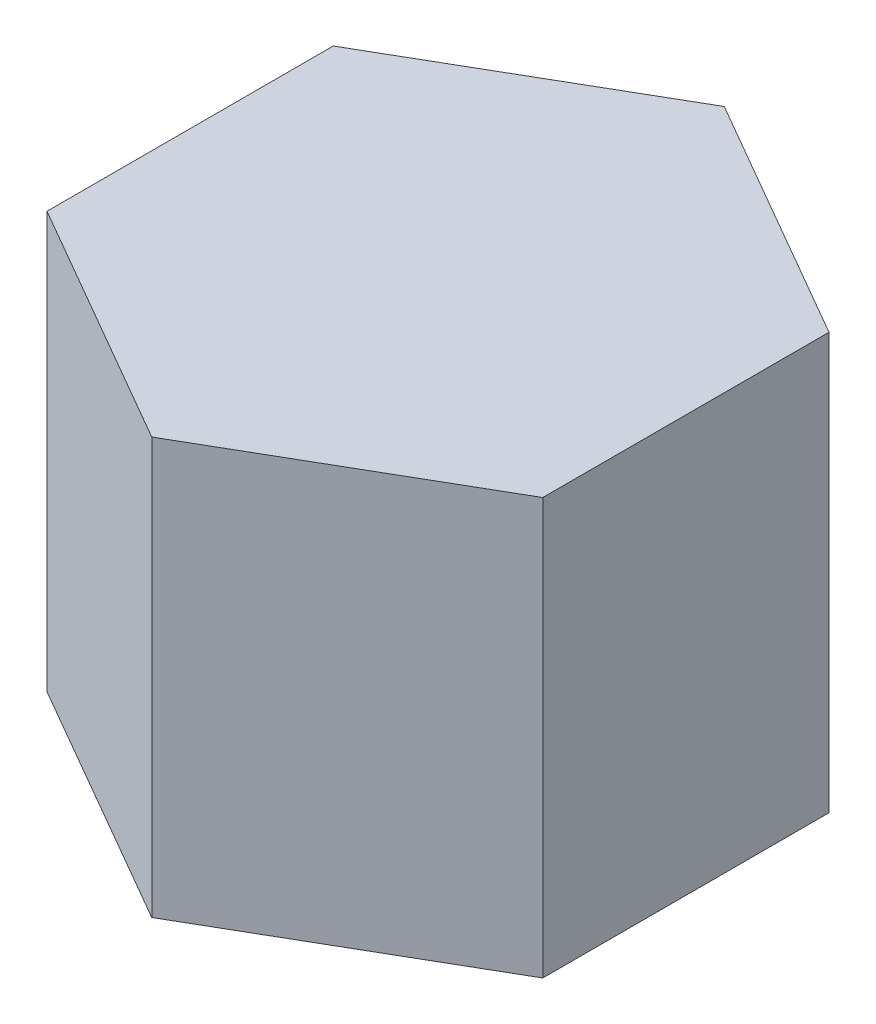
ISO-10303-21;
HEADER;
FILE_DESCRIPTION(('STEP AP214'),'2;1');
FILE_NAME('part.step','',(''),(''),'','','');
FILE_SCHEMA(('AUTOMOTIVE_DESIGN { 1 0 10303 214 1 1 1 1 }'));
ENDSEC;
DATA;
#1=APPLICATION_CONTEXT('core data for automotive mechanical design processes');
#2=APPLICATION_PROTOCOL_DEFINITION('international standard','automotive_design',2000,#1);
#3=PRODUCT_CONTEXT('',#1,'mechanical');
#4=PRODUCT('Part','Part','',(#3));
#5=PRODUCT_RELATED_PRODUCT_CATEGORY('part','',(#4));
#6=PRODUCT_DEFINITION_FORMATION('','',#4);
#7=PRODUCT_DEFINITION_CONTEXT('part definition',#1,'design');
#8=PRODUCT_DEFINITION('design','',#6,#7);
#9=PRODUCT_DEFINITION_SHAPE('','',#8);
#10=(LENGTH_UNIT() NAMED_UNIT(*) SI_UNIT(.MILLI.,.METRE.));
#11=(NAMED_UNIT(*) PLANE_ANGLE_UNIT() SI_UNIT($,.RADIAN.));
#12=(NAMED_UNIT(*) SI_UNIT($,.STERADIAN.) SOLID_ANGLE_UNIT());
#13=UNCERTAINTY_MEASURE_WITH_UNIT(LENGTH_MEASURE(1.E-05),#10,'distance_accuracy_value','');
#14=(GEOMETRIC_REPRESENTATION_CONTEXT(3) GLOBAL_UNCERTAINTY_ASSIGNED_CONTEXT((#13)) GLOBAL_UNIT_ASSIGNED_CONTEXT((#10,
#11,#12)) REPRESENTATION_CONTEXT('',''));
#15=CARTESIAN_POINT('',(0.,0.,0.));
#16=DIRECTION('',(0.,0.,1.));
#17=DIRECTION('',(1.,0.,0.));
#18=AXIS2_PLACEMENT_3D('',#15,#16,#17);
#19=CARTESIAN_POINT('',(204.339551417382,-147.556598747966,295.146072835632));
#20=DIRECTION('',(-0.500000000000096,0.,-0.866025403784383));
#21=DIRECTION('',(-0.866025403784383,0.,0.500000000000096));
#22=AXIS2_PLACEMENT_3D('',#19,#20,#21);
#23=PLANE('',#22);
#24=CARTESIAN_POINT('',(204.642660308706,-147.047793579175,294.971072835632));
#25=DIRECTION('',(-0.866025403784383,0.,0.500000000000096));
#26=VECTOR('',#25,1.);
#27=LINE('',#24,#26);
#28=CARTESIAN_POINT('',(204.642660308706,-147.047793579175,294.971072835632));
#29=VERTEX_POINT('',#28);
#30=CARTESIAN_POINT('',(204.339551417382,-147.047793579175,295.146072835632));
#31=VERTEX_POINT('',#30);
#32=EDGE_CURVE('E170',#29,#31,#27,.T.);
#33=ORIENTED_EDGE('',*,*,#32,.T.);
#34=CARTESIAN_POINT('',(204.339551417382,-147.556598747966,295.146072835632));
#35=DIRECTION('',(0.,1.,0.));
#36=VECTOR('',#35,1.);
#37=LINE('',#34,#36);
#38=CARTESIAN_POINT('',(204.339551417382,-147.556598747966,295.146072835632));
#39=VERTEX_POINT('',#38);
#40=EDGE_CURVE('E35',#39,#31,#37,.T.);
#41=ORIENTED_EDGE('',*,*,#40,.F.);
#42=CARTESIAN_POINT('',(204.642660308706,-147.556598747966,294.971072835632));
#43=DIRECTION('',(-0.866025403784383,0.,0.500000000000096));
#44=VECTOR('',#43,1.);
#45=LINE('',#42,#44);
#46=CARTESIAN_POINT('',(204.642660308706,-147.556598747966,294.971072835632));
#47=VERTEX_POINT('',#46);
#48=EDGE_CURVE('E159',#47,#39,#45,.T.);
#49=ORIENTED_EDGE('',*,*,#48,.F.);
#50=CARTESIAN_POINT('',(204.642660308706,-147.556598747966,294.971072835632));
#51=DIRECTION('',(0.,1.,0.));
#52=VECTOR('',#51,1.);
#53=LINE('',#50,#52);
#54=EDGE_CURVE('E10',#47,#29,#53,.T.);
#55=ORIENTED_EDGE('',*,*,#54,.T.);
#56=EDGE_LOOP('',(#33,#41,#49,#55));
#57=FACE_BOUND('',#56,.T.);
#58=ADVANCED_FACE('F16',(#57),#23,.F.);
#59=CARTESIAN_POINT('',(204.642660308706,-147.556598747966,291.594471220494));
#60=DIRECTION('',(-1.,0.,0.));
#61=DIRECTION('',(0.,-1.,0.));
#62=AXIS2_PLACEMENT_3D('',#59,#60,#61);
#63=PLANE('',#62);
#64=CARTESIAN_POINT('',(204.642660308706,-147.047793579175,294.621072835632));
#65=DIRECTION('',(0.,0.,1.));
#66=VECTOR('',#65,1.);
#67=LINE('',#64,#66);
#68=CARTESIAN_POINT('',(204.642660308706,-147.047793579175,294.621072835632));
#69=VERTEX_POINT('',#68);
#70=EDGE_CURVE('E167',#69,#29,#67,.T.);
#71=ORIENTED_EDGE('',*,*,#70,.T.);
#72=ORIENTED_EDGE('',*,*,#54,.F.);
#73=CARTESIAN_POINT('',(204.642660308706,-147.556598747966,294.621072835632));
#74=DIRECTION('',(0.,0.,1.));
#75=VECTOR('',#74,1.);
#76=LINE('',#73,#75);
#77=CARTESIAN_POINT('',(204.642660308706,-147.556598747966,294.621072835632));
#78=VERTEX_POINT('',#77);
#79=EDGE_CURVE('E156',#78,#47,#76,.T.);
#80=ORIENTED_EDGE('',*,*,#79,.F.);
#81=CARTESIAN_POINT('',(204.642660308706,-147.556598747966,294.621072835632));
#82=DIRECTION('',(0.,1.,0.));
#83=VECTOR('',#82,1.);
#84=LINE('',#81,#83);
#85=EDGE_CURVE('E27',#78,#69,#84,.T.);
#86=ORIENTED_EDGE('',*,*,#85,.T.);
#87=EDGE_LOOP('',(#71,#72,#80,#86));
#88=FACE_BOUND('',#87,.T.);
#89=ADVANCED_FACE('F189',(#88),#63,.F.);
#90=CARTESIAN_POINT('',(204.642660308706,-147.556598747966,294.621072835632));
#91=DIRECTION('',(-0.500000000000062,0.,0.866025403784403));
#92=DIRECTION('',(0.866025403784403,0.,0.500000000000062));
#93=AXIS2_PLACEMENT_3D('',#90,#91,#92);
#94=PLANE('',#93);
#95=CARTESIAN_POINT('',(204.339551417382,-147.047793579175,294.446072835632));
#96=DIRECTION('',(0.866025403784403,0.,0.500000000000062));
#97=VECTOR('',#96,1.);
#98=LINE('',#95,#97);
#99=CARTESIAN_POINT('',(204.339551417382,-147.047793579175,294.446072835632));
#100=VERTEX_POINT('',#99);
#101=EDGE_CURVE('E163',#100,#69,#98,.T.);
#102=ORIENTED_EDGE('',*,*,#101,.T.);
#103=ORIENTED_EDGE('',*,*,#85,.F.);
#104=CARTESIAN_POINT('',(204.339551417382,-147.556598747966,294.446072835632));
#105=DIRECTION('',(0.866025403784403,0.,0.500000000000062));
#106=VECTOR('',#105,1.);
#107=LINE('',#104,#106);
#108=CARTESIAN_POINT('',(204.339551417382,-147.556598747966,294.446072835632));
#109=VERTEX_POINT('',#108);
#110=EDGE_CURVE('E106',#109,#78,#107,.T.);
#111=ORIENTED_EDGE('',*,*,#110,.F.);
#112=CARTESIAN_POINT('',(204.339551417382,-147.556598747966,294.446072835632));
#113=DIRECTION('',(0.,1.,0.));
#114=VECTOR('',#113,1.);
#115=LINE('',#112,#114);
#116=EDGE_CURVE('E94',#109,#100,#115,.T.);
#117=ORIENTED_EDGE('',*,*,#116,.T.);
#118=EDGE_LOOP('',(#102,#103,#111,#117));
#119=FACE_BOUND('',#118,.T.);
#120=ADVANCED_FACE('F198',(#119),#94,.F.);
#121=CARTESIAN_POINT('',(204.339551417382,-147.556598747966,294.446072835632));
#122=DIRECTION('',(0.500000000000096,0.,0.866025403784383));
#123=DIRECTION('',(0.866025403784383,0.,-0.500000000000096));
#124=AXIS2_PLACEMENT_3D('',#121,#122,#123);
#125=PLANE('',#124);
#126=CARTESIAN_POINT('',(204.036442526057,-147.047793579175,294.621072835632));
#127=DIRECTION('',(0.866025403784383,0.,-0.500000000000096));
#128=VECTOR('',#127,1.);
#129=LINE('',#126,#128);
#130=CARTESIAN_POINT('',(204.036442526057,-147.047793579175,294.621072835632));
#131=VERTEX_POINT('',#130);
#132=EDGE_CURVE('E162',#131,#100,#129,.T.);
#133=ORIENTED_EDGE('',*,*,#132,.T.);
#134=ORIENTED_EDGE('',*,*,#116,.F.);
#135=CARTESIAN_POINT('',(204.036442526057,-147.556598747966,294.621072835632));
#136=DIRECTION('',(0.866025403784383,0.,-0.500000000000096));
#137=VECTOR('',#136,1.);
#138=LINE('',#135,#137);
#139=CARTESIAN_POINT('',(204.036442526057,-147.556598747966,294.621072835632));
#140=VERTEX_POINT('',#139);
#141=EDGE_CURVE('E98',#140,#109,#138,.T.);
#142=ORIENTED_EDGE('',*,*,#141,.F.);
#143=CARTESIAN_POINT('',(204.036442526057,-147.556598747966,294.621072835632));
#144=DIRECTION('',(0.,1.,0.));
#145=VECTOR('',#144,1.);
#146=LINE('',#143,#145);
#147=EDGE_CURVE('E79',#140,#131,#146,.T.);
#148=ORIENTED_EDGE('',*,*,#147,.T.);
#149=EDGE_LOOP('',(#133,#134,#142,#148));
#150=FACE_BOUND('',#149,.T.);
#151=ADVANCED_FACE('F100',(#150),#125,.F.);
#152=CARTESIAN_POINT('',(204.036442526057,-147.556598747966,291.594471220494));
#153=DIRECTION('',(1.,0.,0.));
#154=DIRECTION('',(0.,1.,0.));
#155=AXIS2_PLACEMENT_3D('',#152,#153,#154);
#156=PLANE('',#155);
#157=CARTESIAN_POINT('',(204.036442526057,-147.047793579175,294.971072835632));
#158=DIRECTION('',(0.,0.,-1.));
#159=VECTOR('',#158,1.);
#160=LINE('',#157,#159);
#161=CARTESIAN_POINT('',(204.036442526057,-147.047793579175,294.971072835632));
#162=VERTEX_POINT('',#161);
#163=EDGE_CURVE('E88',#162,#131,#160,.T.);
#164=ORIENTED_EDGE('',*,*,#163,.T.);
#165=ORIENTED_EDGE('',*,*,#147,.F.);
#166=CARTESIAN_POINT('',(204.036442526057,-147.556598747966,294.971072835632));
#167=DIRECTION('',(0.,0.,-1.));
#168=VECTOR('',#167,1.);
#169=LINE('',#166,#168);
#170=CARTESIAN_POINT('',(204.036442526057,-147.556598747966,294.971072835632));
#171=VERTEX_POINT('',#170);
#172=EDGE_CURVE('E84',#171,#140,#169,.T.);
#173=ORIENTED_EDGE('',*,*,#172,.F.);
#174=CARTESIAN_POINT('',(204.036442526057,-147.556598747966,294.971072835632));
#175=DIRECTION('',(0.,1.,0.));
#176=VECTOR('',#175,1.);
#177=LINE('',#174,#176);
#178=EDGE_CURVE('E58',#171,#162,#177,.T.);
#179=ORIENTED_EDGE('',*,*,#178,.T.);
#180=EDGE_LOOP('',(#164,#165,#173,#179));
#181=FACE_BOUND('',#180,.T.);
#182=ADVANCED_FACE('F82',(#181),#156,.F.);
#183=CARTESIAN_POINT('',(204.036442526057,-147.556598747966,294.971072835632));
#184=DIRECTION('',(0.499999999999978,0.,-0.866025403784452));
#185=DIRECTION('',(-0.866025403784452,0.,-0.499999999999978));
#186=AXIS2_PLACEMENT_3D('',#183,#184,#185);
#187=PLANE('',#186);
#188=CARTESIAN_POINT('',(204.339551417382,-147.047793579175,295.146072835632));
#189=DIRECTION('',(-0.866025403784452,0.,-0.499999999999978));
#190=VECTOR('',#189,1.);
#191=LINE('',#188,#190);
#192=EDGE_CURVE('E160',#31,#162,#191,.T.);
#193=ORIENTED_EDGE('',*,*,#192,.T.);
#194=ORIENTED_EDGE('',*,*,#178,.F.);
#195=CARTESIAN_POINT('',(204.339551417382,-147.556598747966,295.146072835632));
#196=DIRECTION('',(-0.866025403784452,0.,-0.499999999999978));
#197=VECTOR('',#196,1.);
#198=LINE('',#195,#197);
#199=EDGE_CURVE('E112',#39,#171,#198,.T.);
#200=ORIENTED_EDGE('',*,*,#199,.F.);
#201=ORIENTED_EDGE('',*,*,#40,.T.);
#202=EDGE_LOOP('',(#193,#194,#200,#201));
#203=FACE_BOUND('',#202,.T.);
#204=ADVANCED_FACE('F131',(#203),#187,.F.);
#205=CARTESIAN_POINT('',(206.491105863044,-147.556598747966,291.594471220494));
#206=DIRECTION('',(0.,1.,0.));
#207=DIRECTION('',(-1.,0.,0.));
#208=AXIS2_PLACEMENT_3D('',#205,#206,#207);
#209=PLANE('',#208);
#210=ORIENTED_EDGE('',*,*,#48,.T.);
#211=ORIENTED_EDGE('',*,*,#199,.T.);
#212=ORIENTED_EDGE('',*,*,#172,.T.);
#213=ORIENTED_EDGE('',*,*,#141,.T.);
#214=ORIENTED_EDGE('',*,*,#110,.T.);
#215=ORIENTED_EDGE('',*,*,#79,.T.);
#216=EDGE_LOOP('',(#210,#211,#212,#213,#214,#215));
#217=FACE_BOUND('',#216,.T.);
#218=ADVANCED_FACE('F111',(#217),#209,.F.);
#219=CARTESIAN_POINT('',(206.491105863044,-147.047793579175,291.594471220494));
#220=DIRECTION('',(0.,1.,0.));
#221=DIRECTION('',(-1.,0.,0.));
#222=AXIS2_PLACEMENT_3D('',#219,#220,#221);
#223=PLANE('',#222);
#224=ORIENTED_EDGE('',*,*,#32,.F.);
#225=ORIENTED_EDGE('',*,*,#70,.F.);
#226=ORIENTED_EDGE('',*,*,#101,.F.);
#227=ORIENTED_EDGE('',*,*,#132,.F.);
#228=ORIENTED_EDGE('',*,*,#163,.F.);
#229=ORIENTED_EDGE('',*,*,#192,.F.);
#230=EDGE_LOOP('',(#224,#225,#226,#227,#228,#229));
#231=FACE_BOUND('',#230,.T.);
#232=ADVANCED_FACE('F130',(#231),#223,.T.);
#233=CLOSED_SHELL('',(#58,#89,#120,#151,#182,#204,#218,#232));
#234=MANIFOLD_SOLID_BREP('B1',#233);
#235=ADVANCED_BREP_SHAPE_REPRESENTATION('',(#18,#234),#14);
#236=SHAPE_DEFINITION_REPRESENTATION(#9,#235);
ENDSEC;
END-ISO-10303-21;
